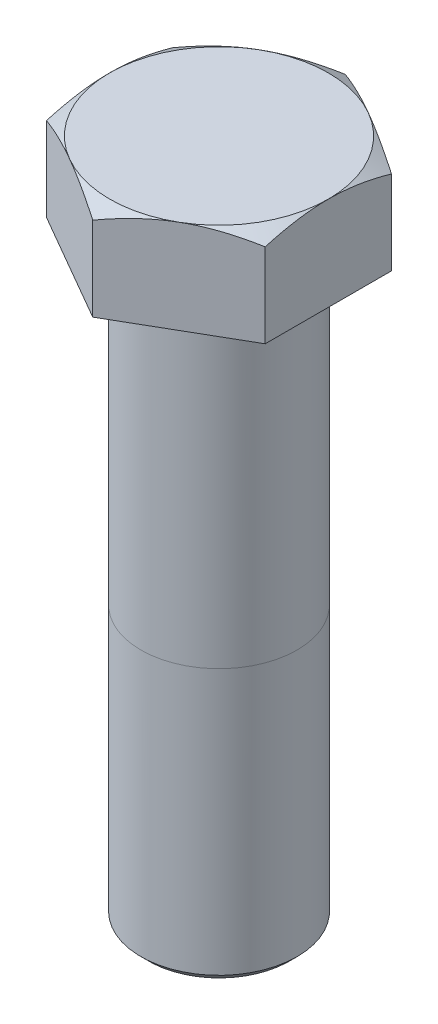
ISO-10303-21;
HEADER;
FILE_DESCRIPTION(('STEP AP214'),'2;1');
FILE_NAME('part.step','',(''),(''),'','','');
FILE_SCHEMA(('AUTOMOTIVE_DESIGN { 1 0 10303 214 1 1 1 1 }'));
ENDSEC;
DATA;
#1=APPLICATION_CONTEXT('core data for automotive mechanical design processes');
#2=APPLICATION_PROTOCOL_DEFINITION('international standard','automotive_design',2000,#1);
#3=PRODUCT_CONTEXT('',#1,'mechanical');
#4=PRODUCT('Part','Part','',(#3));
#5=PRODUCT_RELATED_PRODUCT_CATEGORY('part','',(#4));
#6=PRODUCT_DEFINITION_FORMATION('','',#4);
#7=PRODUCT_DEFINITION_CONTEXT('part definition',#1,'design');
#8=PRODUCT_DEFINITION('design','',#6,#7);
#9=PRODUCT_DEFINITION_SHAPE('','',#8);
#10=(LENGTH_UNIT() NAMED_UNIT(*) SI_UNIT(.MILLI.,.METRE.));
#11=(NAMED_UNIT(*) PLANE_ANGLE_UNIT() SI_UNIT($,.RADIAN.));
#12=(NAMED_UNIT(*) SI_UNIT($,.STERADIAN.) SOLID_ANGLE_UNIT());
#13=UNCERTAINTY_MEASURE_WITH_UNIT(LENGTH_MEASURE(1.E-05),#10,'distance_accuracy_value','');
#14=(GEOMETRIC_REPRESENTATION_CONTEXT(3) GLOBAL_UNCERTAINTY_ASSIGNED_CONTEXT((#13)) GLOBAL_UNIT_ASSIGNED_CONTEXT((#10,
#11,#12)) REPRESENTATION_CONTEXT('',''));
#15=CARTESIAN_POINT('',(0.,0.,0.));
#16=DIRECTION('',(0.,0.,1.));
#17=DIRECTION('',(1.,0.,0.));
#18=AXIS2_PLACEMENT_3D('',#15,#16,#17);
#19=CARTESIAN_POINT('',(0.,-75.,0.));
#20=DIRECTION('',(0.,1.,0.));
#21=DIRECTION('',(0.,0.,1.));
#22=AXIS2_PLACEMENT_3D('',#19,#20,#21);
#23=CYLINDRICAL_SURFACE('',#22,10.);
#24=CARTESIAN_POINT('',(0.,-74.,0.));
#25=DIRECTION('',(0.,-1.,0.));
#26=DIRECTION('',(0.,0.,-1.));
#27=AXIS2_PLACEMENT_3D('',#24,#25,#26);
#28=CIRCLE('',#27,10.);
#29=CARTESIAN_POINT('',(0.,-74.,-10.));
#30=VERTEX_POINT('',#29);
#31=EDGE_CURVE('E247',#30,#30,#28,.F.);
#32=ORIENTED_EDGE('',*,*,#31,.T.);
#33=EDGE_LOOP('',(#32));
#34=FACE_BOUND('',#33,.T.);
#35=CARTESIAN_POINT('',(0.,-40.,0.));
#36=DIRECTION('',(0.,1.,0.));
#37=DIRECTION('',(0.,0.,1.));
#38=AXIS2_PLACEMENT_3D('',#35,#36,#37);
#39=CIRCLE('',#38,10.);
#40=CARTESIAN_POINT('',(10.,-40.,0.));
#41=VERTEX_POINT('',#40);
#42=CARTESIAN_POINT('',(-10.,-40.,0.));
#43=VERTEX_POINT('',#42);
#44=EDGE_CURVE('E12',#41,#43,#39,.T.);
#45=ORIENTED_EDGE('',*,*,#44,.F.);
#46=EDGE_CURVE('E46',#43,#41,#39,.T.);
#47=ORIENTED_EDGE('',*,*,#46,.F.);
#48=EDGE_LOOP('',(#45,#47));
#49=FACE_BOUND('',#48,.T.);
#50=ADVANCED_FACE('F42',(#34,#49),#23,.T.);
#51=CARTESIAN_POINT('',(14.,12.,8.08290376865476));
#52=DIRECTION('',(-1.,0.,0.));
#53=DIRECTION('',(0.,0.,1.));
#54=AXIS2_PLACEMENT_3D('',#51,#52,#53);
#55=PLANE('',#54);
#56=CARTESIAN_POINT('',(14.,4.99292627411983,-22.0708464349856));
#57=CARTESIAN_POINT('',(14.,5.14275125073714,-21.763531713594));
#58=CARTESIAN_POINT('',(14.,5.2918557374687,-21.4558658946682));
#59=CARTESIAN_POINT('',(14.,5.58846120919052,-20.8397589075048));
#60=CARTESIAN_POINT('',(14.,5.73596217910168,-20.5313177320094));
#61=CARTESIAN_POINT('',(14.,6.17585267186017,-19.6046440518659));
#62=CARTESIAN_POINT('',(14.,6.46558794103416,-18.9851469805474));
#63=CARTESIAN_POINT('',(14.,7.03777843217461,-17.7389229296623));
#64=CARTESIAN_POINT('',(14.,7.32018844259814,-17.1121751438084));
#65=CARTESIAN_POINT('',(14.,7.87392351617632,-15.8538185498974));
#66=CARTESIAN_POINT('',(14.,8.1452490804189,-15.2222099631169));
#67=CARTESIAN_POINT('',(14.,8.68287642466604,-13.9315623858743));
#68=CARTESIAN_POINT('',(14.,8.94869404876374,-13.2723206995769));
#69=CARTESIAN_POINT('',(14.,9.46106816037286,-11.9462542996072));
#70=CARTESIAN_POINT('',(14.,9.70762253788817,-11.279428764378));
#71=CARTESIAN_POINT('',(14.,10.1752562829552,-9.93829007470015));
#72=CARTESIAN_POINT('',(14.,10.396384227389,-9.26399399013318));
#73=CARTESIAN_POINT('',(14.,10.8063230716423,-7.90567438619098));
#74=CARTESIAN_POINT('',(14.,10.9951437751515,-7.22165388619106));
#75=CARTESIAN_POINT('',(14.,11.2469826274844,-6.19005259244248));
#76=CARTESIAN_POINT('',(14.,11.3255182689362,-5.84623937601681));
#77=CARTESIAN_POINT('',(14.,11.4712203231808,-5.15619981120414));
#78=CARTESIAN_POINT('',(14.,11.5383869516181,-4.80997350871765));
#79=CARTESIAN_POINT('',(14.,11.6601886053096,-4.11532107569089));
#80=CARTESIAN_POINT('',(14.,11.7148239340997,-3.76689499864416));
#81=CARTESIAN_POINT('',(14.,11.8104879102852,-3.06818296151865));
#82=CARTESIAN_POINT('',(14.,11.8515171744298,-2.71789708647414));
#83=CARTESIAN_POINT('',(14.,11.9186189966348,-2.02068299874687));
#84=CARTESIAN_POINT('',(14.,11.9448869150742,-1.67377370516229));
#85=CARTESIAN_POINT('',(14.,11.9827143530094,-0.979154587539554));
#86=CARTESIAN_POINT('',(14.,11.9942741270491,-0.631444777459724));
#87=CARTESIAN_POINT('',(14.,12.0024083352431,0.0641555436403101));
#88=CARTESIAN_POINT('',(14.,11.9989826831407,0.412046055689117));
#89=CARTESIAN_POINT('',(14.,11.9772334595719,1.10736454649816));
#90=CARTESIAN_POINT('',(14.,11.9589092283266,1.4547925040918));
#91=CARTESIAN_POINT('',(14.,11.8981630222529,2.27898980794397));
#92=CARTESIAN_POINT('',(14.,11.8492724601065,2.75529344550535));
#93=CARTESIAN_POINT('',(14.,11.7260767898435,3.70457641615979));
#94=CARTESIAN_POINT('',(14.,11.6517685310033,4.17755532970575));
#95=CARTESIAN_POINT('',(14.,11.3946404748962,5.5908323945973));
#96=CARTESIAN_POINT('',(14.,11.1776561389664,6.52500889593941));
#97=CARTESIAN_POINT('',(14.,10.798626820434,7.9226389185731));
#98=CARTESIAN_POINT('',(14.,10.6614717947017,8.39326123057304));
#99=CARTESIAN_POINT('',(14.,10.3722342331957,9.32994176724345));
#100=CARTESIAN_POINT('',(14.,10.2201515814648,9.79599995642904));
#101=CARTESIAN_POINT('',(14.,9.90355317631269,10.7236894043673));
#102=CARTESIAN_POINT('',(14.,9.73904087835879,11.1853218535627));
#103=CARTESIAN_POINT('',(14.,9.39959441341048,12.1047171749783));
#104=CARTESIAN_POINT('',(14.,9.22466049104052,12.5624801377385));
#105=CARTESIAN_POINT('',(14.,8.89155940415481,13.4097205820374));
#106=CARTESIAN_POINT('',(14.,8.73454468424756,13.7996530958132));
#107=CARTESIAN_POINT('',(14.,8.41497628488326,14.5772449404882));
#108=CARTESIAN_POINT('',(14.,8.25242251511154,14.9649042342014));
#109=CARTESIAN_POINT('',(14.,7.75759096859983,16.1248984757426));
#110=CARTESIAN_POINT('',(14.,7.41816794173889,16.8941869656031));
#111=CARTESIAN_POINT('',(14.,6.72486730980364,18.426543943353));
#112=CARTESIAN_POINT('',(14.,6.37098406545459,19.1896098626505));
#113=CARTESIAN_POINT('',(14.,5.65222073830814,20.7104937194635));
#114=CARTESIAN_POINT('',(14.,5.28734111642613,21.4683118753073));
#115=CARTESIAN_POINT('',(14.,4.54839511560173,22.980981438601));
#116=CARTESIAN_POINT('',(14.,4.17431468233873,23.7358259632096));
#117=CARTESIAN_POINT('',(14.,3.41933164006676,25.2420982335973));
#118=CARTESIAN_POINT('',(14.,3.03842897255752,25.9935259500081));
#119=CARTESIAN_POINT('',(14.,2.27123454463828,27.4934100989246));
#120=CARTESIAN_POINT('',(14.,1.88494400638628,28.2418671573457));
#121=CARTESIAN_POINT('',(14.,1.10790624992866,29.7364586122523));
#122=CARTESIAN_POINT('',(14.,0.71715904651957,30.4825930164389));
#123=CARTESIAN_POINT('',(14.,-0.376681710678396,32.558895705312));
#124=CARTESIAN_POINT('',(14.,-1.08377517374297,33.8869563019828));
#125=CARTESIAN_POINT('',(14.,-2.50642277339758,36.5386359764744));
#126=CARTESIAN_POINT('',(14.,-3.22197744331924,37.8622547674929));
#127=CARTESIAN_POINT('',(14.,-4.65694236685034,40.5015600986259));
#128=CARTESIAN_POINT('',(14.,-5.37633118483277,41.8172583005949));
#129=CARTESIAN_POINT('',(14.,-6.45898623229571,43.7887734158136));
#130=CARTESIAN_POINT('',(14.,-6.82045208995986,44.4455803149352));
#131=CARTESIAN_POINT('',(14.,-7.54445048557498,45.7586049329431));
#132=CARTESIAN_POINT('',(14.,-7.90698302220202,46.4148226525593));
#133=CARTESIAN_POINT('',(14.,-8.26998269061017,47.0707819322765));
#134=B_SPLINE_CURVE_WITH_KNOTS('',3,(#56,#57,#58,#59,#60,#61,#62,#63,#64,#65,#66,#67,#68,#69,
#70,#71,#72,#73,#74,#75,#76,#77,#78,#79,#80,#81,#82,#83,#84,#85,#86,#87,#88,#89,#90,#91,#92,#93,
#94,#95,#96,#97,#98,#99,#100,#101,#102,#103,#104,#105,#106,#107,#108,#109,#110,#111,#112,#113,
#114,#115,#116,#117,#118,#119,#120,#121,#122,#123,#124,#125,#126,#127,#128,#129,#130,#131,#132,
#133),.UNSPECIFIED.,.F.,.F.,(4,2,2,2,2,2,2,2,2,2,2,2,2,2,2,2,2,2,2,2,2,2,2,2,2,2,2,2,2,2,2,2,2,
2,2,2,2,2,4),(0.,1.02567303415568,2.05135570517911,4.10300682741262,6.16523090737517,
8.2273616582163,10.3595780473828,12.4920276619918,14.6203330796551,16.7479915093961,
17.8058407791356,18.8636699816202,19.9214735584228,20.979229179497,22.022634632188,
23.066022027118,24.1094154278302,25.1528550374109,26.5884704486536,28.0242638802512,
30.8972352289157,32.3677049505682,33.8381860956821,35.3082599376037,36.7782992863959,
38.0393272664398,39.3003758174946,41.8226756734989,44.3459687576769,46.869156224211,
49.3964720626359,51.9238095830388,54.450582848693,56.977347727673,61.4910052964854,
66.0049489056214,70.5035167422898,72.7526215874592,75.0017236422816),.UNSPECIFIED.);
#135=CARTESIAN_POINT('',(14.,10.7495704353214,8.08290376865476));
#136=VERTEX_POINT('',#135);
#137=CARTESIAN_POINT('',(14.,12.,0.));
#138=VERTEX_POINT('',#137);
#139=EDGE_CURVE('E115',#136,#138,#134,.F.);
#140=ORIENTED_EDGE('',*,*,#139,.F.);
#141=DIRECTION('',(0.,-1.,0.));
#142=VECTOR('',#141,1.);
#143=CARTESIAN_POINT('',(14.,12.,8.08290376865476));
#144=LINE('',#143,#142);
#145=CARTESIAN_POINT('',(14.,0.,8.08290376865476));
#146=VERTEX_POINT('',#145);
#147=EDGE_CURVE('E262',#136,#146,#144,.T.);
#148=ORIENTED_EDGE('',*,*,#147,.T.);
#149=DIRECTION('',(0.,0.,-1.));
#150=VECTOR('',#149,1.);
#151=CARTESIAN_POINT('',(14.,0.,8.08290376865476));
#152=LINE('',#151,#150);
#153=CARTESIAN_POINT('',(14.,0.,-8.08290376865476));
#154=VERTEX_POINT('',#153);
#155=EDGE_CURVE('E125',#146,#154,#152,.T.);
#156=ORIENTED_EDGE('',*,*,#155,.T.);
#157=DIRECTION('',(0.,-1.,0.));
#158=VECTOR('',#157,1.);
#159=CARTESIAN_POINT('',(14.,12.,-8.08290376865476));
#160=LINE('',#159,#158);
#161=CARTESIAN_POINT('',(14.,10.7495704353214,-8.08290376865476));
#162=VERTEX_POINT('',#161);
#163=EDGE_CURVE('E150',#162,#154,#160,.T.);
#164=ORIENTED_EDGE('',*,*,#163,.F.);
#165=EDGE_CURVE('E126',#138,#162,#134,.F.);
#166=ORIENTED_EDGE('',*,*,#165,.F.);
#167=EDGE_LOOP('',(#140,#148,#156,#164,#166));
#168=FACE_BOUND('',#167,.T.);
#169=ADVANCED_FACE('F148',(#168),#55,.F.);
#170=CARTESIAN_POINT('',(14.,12.,-8.08290376865476));
#171=DIRECTION('',(-0.5,0.,0.866025403784439));
#172=DIRECTION('',(0.866025403784439,0.,0.5));
#173=AXIS2_PLACEMENT_3D('',#170,#171,#172);
#174=PLANE('',#173);
#175=CARTESIAN_POINT('',(14.0002,10.7495037679405,-8.08278829860092));
#176=CARTESIAN_POINT('',(13.6924853904181,10.8520687355185,-8.26044741127663));
#177=CARTESIAN_POINT('',(13.3835705284393,10.9499795109551,-8.43879948999676));
#178=CARTESIAN_POINT('',(12.7632636692859,11.1351989694353,-8.79693382210911));
#179=CARTESIAN_POINT('',(12.4518708930622,11.2225041654761,-8.97671652528557));
#180=CARTESIAN_POINT('',(11.8260063991707,11.3853389062415,-9.33805955931008));
#181=CARTESIAN_POINT('',(11.5115292047329,11.4608405894043,-9.51962305217276));
#182=CARTESIAN_POINT('',(10.8803895759989,11.5984470625897,-9.88401168671854));
#183=CARTESIAN_POINT('',(10.5637272674325,11.6605526168897,-10.0668367558116));
#184=CARTESIAN_POINT('',(9.93633151674919,11.7687252680104,-10.429063861357));
#185=CARTESIAN_POINT('',(9.62564465325543,11.8151503964399,-10.6084390056288));
#186=CARTESIAN_POINT('',(9.00284729327513,11.8929951265451,-10.968011229064));
#187=CARTESIAN_POINT('',(8.69073676950318,11.9244144393938,-11.1482083239807));
#188=CARTESIAN_POINT('',(8.06599141476663,11.9714542186344,-11.5089052227128));
#189=CARTESIAN_POINT('',(7.75335765114504,11.9870934589966,-11.6894044102975));
#190=CARTESIAN_POINT('',(7.12780152662096,12.0022367596143,-12.0505694071847));
#191=CARTESIAN_POINT('',(6.81487917493453,12.0017413184259,-12.2312352111663));
#192=CARTESIAN_POINT('',(6.22987230119103,11.9857422399056,-12.5689890871999));
#193=CARTESIAN_POINT('',(5.95774609067865,11.9721901053227,-12.7261012280928));
#194=CARTESIAN_POINT('',(5.4141196223319,11.9331392398875,-13.0399641159314));
#195=CARTESIAN_POINT('',(5.14261941013851,11.9076396640127,-13.1967148365263));
#196=CARTESIAN_POINT('',(4.60039240839668,11.8451385190432,-13.5097697419438));
#197=CARTESIAN_POINT('',(4.32966644468922,11.8081274502385,-13.6660734499669));
#198=CARTESIAN_POINT('',(3.78948373337593,11.7232526731859,-13.9779480837552));
#199=CARTESIAN_POINT('',(3.52002707332628,11.6753882271492,-14.1335189589698));
#200=CARTESIAN_POINT('',(2.70207638818785,11.514304872236,-14.6057630072183));
#201=CARTESIAN_POINT('',(2.15595101855753,11.3850242516312,-14.9210686363857));
#202=CARTESIAN_POINT('',(1.07184369066131,11.0916100987946,-15.546978293977));
#203=CARTESIAN_POINT('',(0.53384785211266,10.9275454762133,-15.857590336186));
#204=CARTESIAN_POINT('',(-0.000199999999997906,10.7495037679405,-16.1659230073634));
#205=B_SPLINE_CURVE_WITH_KNOTS('',3,(#175,#176,#177,#178,#179,#180,#181,#182,#183,#184,#185,
#186,#187,#188,#189,#190,#191,#192,#193,#194,#195,#196,#197,#198,#199,#200,#201,#202,#203,#204),
.UNSPECIFIED.,.F.,.F.,(4,2,2,2,2,2,2,2,2,2,2,2,2,2,4),(0.,1.10950436744395,2.21937254652007,
3.33182219257025,4.44420835421649,5.52913815688045,6.6140888410734,7.69774720328185,
8.78137208085321,9.72469383358151,10.6680823159394,11.6122513923123,12.5564846704803,
14.4864746839191,16.412676387916),.UNSPECIFIED.);
#206=CARTESIAN_POINT('',(7.,12.,-12.1243556529821));
#207=VERTEX_POINT('',#206);
#208=EDGE_CURVE('E133',#162,#207,#205,.T.);
#209=ORIENTED_EDGE('',*,*,#208,.F.);
#210=ORIENTED_EDGE('',*,*,#163,.T.);
#211=DIRECTION('',(-0.866025403784439,0.,-0.5));
#212=VECTOR('',#211,1.);
#213=CARTESIAN_POINT('',(14.,0.,-8.08290376865476));
#214=LINE('',#213,#212);
#215=CARTESIAN_POINT('',(0.,0.,-16.1658075373095));
#216=VERTEX_POINT('',#215);
#217=EDGE_CURVE('E275',#154,#216,#214,.T.);
#218=ORIENTED_EDGE('',*,*,#217,.T.);
#219=DIRECTION('',(0.,-1.,0.));
#220=VECTOR('',#219,1.);
#221=CARTESIAN_POINT('',(0.,12.,-16.1658075373095));
#222=LINE('',#221,#220);
#223=CARTESIAN_POINT('',(0.,10.7495704353214,-16.1658075373095));
#224=VERTEX_POINT('',#223);
#225=EDGE_CURVE('E254',#224,#216,#222,.T.);
#226=ORIENTED_EDGE('',*,*,#225,.F.);
#227=EDGE_CURVE('E151',#207,#224,#205,.T.);
#228=ORIENTED_EDGE('',*,*,#227,.F.);
#229=EDGE_LOOP('',(#209,#210,#218,#226,#228));
#230=FACE_BOUND('',#229,.T.);
#231=ADVANCED_FACE('F171',(#230),#174,.F.);
#232=CARTESIAN_POINT('',(0.,12.,-16.1658075373095));
#233=DIRECTION('',(0.5,0.,0.866025403784439));
#234=DIRECTION('',(0.866025403784439,0.,-0.5));
#235=AXIS2_PLACEMENT_3D('',#232,#233,#234);
#236=PLANE('',#235);
#237=CARTESIAN_POINT('',(0.000200000000002302,10.7495037679405,-16.1659230073634));
#238=CARTESIAN_POINT('',(-0.307514609581917,10.8520687355185,-15.9882638946877));
#239=CARTESIAN_POINT('',(-0.616429471560715,10.9499795109551,-15.8099118159675));
#240=CARTESIAN_POINT('',(-1.23673633071406,11.1351989694353,-15.4517774838552));
#241=CARTESIAN_POINT('',(-1.54812910693775,11.2225041654761,-15.2719947806787));
#242=CARTESIAN_POINT('',(-2.17399360082929,11.3853389062415,-14.9106517466542));
#243=CARTESIAN_POINT('',(-2.48847079526713,11.4608405894043,-14.7290882537915));
#244=CARTESIAN_POINT('',(-3.11961042400106,11.5984470625897,-14.3646996192457));
#245=CARTESIAN_POINT('',(-3.43627273256745,11.6605526168897,-14.1818745501527));
#246=CARTESIAN_POINT('',(-4.06366848325081,11.7687252680104,-13.8196474446073));
#247=CARTESIAN_POINT('',(-4.37435534674457,11.8151503964399,-13.6402723003355));
#248=CARTESIAN_POINT('',(-4.99715270672487,11.8929951265451,-13.2807000769003));
#249=CARTESIAN_POINT('',(-5.30926323049682,11.9244144393938,-13.1005029819836));
#250=CARTESIAN_POINT('',(-5.93400858523337,11.9714542186344,-12.7398060832515));
#251=CARTESIAN_POINT('',(-6.24664234885496,11.9870934589966,-12.5593068956668));
#252=CARTESIAN_POINT('',(-6.87219847337904,12.0022367596143,-12.1981418987796));
#253=CARTESIAN_POINT('',(-7.18512082506546,12.0017413184259,-12.017476094798));
#254=CARTESIAN_POINT('',(-7.77012769880897,11.9857422399056,-11.6797222187644));
#255=CARTESIAN_POINT('',(-8.04225390932135,11.9721901053227,-11.5226100778715));
#256=CARTESIAN_POINT('',(-8.5858803776681,11.9331392398875,-11.2087471900329));
#257=CARTESIAN_POINT('',(-8.85738058986148,11.9076396640127,-11.051996469438));
#258=CARTESIAN_POINT('',(-9.39960759160332,11.8451385190432,-10.7389415640205));
#259=CARTESIAN_POINT('',(-9.67033355531079,11.8081274502385,-10.5826378559974));
#260=CARTESIAN_POINT('',(-10.2105162666241,11.7232526731859,-10.2707632222091));
#261=CARTESIAN_POINT('',(-10.4799729266737,11.6753882271492,-10.1151923469945));
#262=CARTESIAN_POINT('',(-11.2979236118122,11.514304872236,-9.64294829874595));
#263=CARTESIAN_POINT('',(-11.8440489814425,11.3850242516312,-9.3276426695786));
#264=CARTESIAN_POINT('',(-12.9281563093387,11.0916100987946,-8.70173301198727));
#265=CARTESIAN_POINT('',(-13.4661521478873,10.9275454762133,-8.39112096977831));
#266=CARTESIAN_POINT('',(-14.0002,10.7495037679405,-8.08278829860092));
#267=B_SPLINE_CURVE_WITH_KNOTS('',3,(#237,#238,#239,#240,#241,#242,#243,#244,#245,#246,#247,
#248,#249,#250,#251,#252,#253,#254,#255,#256,#257,#258,#259,#260,#261,#262,#263,#264,#265,#266),
.UNSPECIFIED.,.F.,.F.,(4,2,2,2,2,2,2,2,2,2,2,2,2,2,4),(0.,1.10950436744395,2.21937254652007,
3.33182219257025,4.44420835421649,5.52913815688045,6.6140888410734,7.69774720328185,
8.78137208085321,9.72469383358151,10.6680823159394,11.6122513923123,12.5564846704803,
14.4864746839191,16.412676387916),.UNSPECIFIED.);
#268=CARTESIAN_POINT('',(-7.,12.,-12.1243556529821));
#269=VERTEX_POINT('',#268);
#270=EDGE_CURVE('E190',#224,#269,#267,.T.);
#271=ORIENTED_EDGE('',*,*,#270,.F.);
#272=ORIENTED_EDGE('',*,*,#225,.T.);
#273=DIRECTION('',(-0.866025403784439,0.,0.5));
#274=VECTOR('',#273,1.);
#275=CARTESIAN_POINT('',(0.,0.,-16.1658075373095));
#276=LINE('',#275,#274);
#277=CARTESIAN_POINT('',(-14.,0.,-8.08290376865476));
#278=VERTEX_POINT('',#277);
#279=EDGE_CURVE('E273',#216,#278,#276,.T.);
#280=ORIENTED_EDGE('',*,*,#279,.T.);
#281=DIRECTION('',(0.,-1.,0.));
#282=VECTOR('',#281,1.);
#283=CARTESIAN_POINT('',(-14.,12.,-8.08290376865476));
#284=LINE('',#283,#282);
#285=CARTESIAN_POINT('',(-14.,10.7495704353214,-8.08290376865476));
#286=VERTEX_POINT('',#285);
#287=EDGE_CURVE('E256',#286,#278,#284,.T.);
#288=ORIENTED_EDGE('',*,*,#287,.F.);
#289=EDGE_CURVE('E184',#269,#286,#267,.T.);
#290=ORIENTED_EDGE('',*,*,#289,.F.);
#291=EDGE_LOOP('',(#271,#272,#280,#288,#290));
#292=FACE_BOUND('',#291,.T.);
#293=ADVANCED_FACE('F175',(#292),#236,.F.);
#294=CARTESIAN_POINT('',(-14.,12.,-8.08290376865476));
#295=DIRECTION('',(1.,0.,0.));
#296=DIRECTION('',(0.,0.,-1.));
#297=AXIS2_PLACEMENT_3D('',#294,#295,#296);
#298=PLANE('',#297);
#299=CARTESIAN_POINT('',(-14.,4.99292627411983,-22.0708464349856));
#300=CARTESIAN_POINT('',(-14.,5.14275125073714,-21.763531713594));
#301=CARTESIAN_POINT('',(-14.,5.2918557374687,-21.4558658946682));
#302=CARTESIAN_POINT('',(-14.,5.58846120919052,-20.8397589075048));
#303=CARTESIAN_POINT('',(-14.,5.73596217910168,-20.5313177320094));
#304=CARTESIAN_POINT('',(-14.,6.17585267186017,-19.6046440518659));
#305=CARTESIAN_POINT('',(-14.,6.46558794103416,-18.9851469805474));
#306=CARTESIAN_POINT('',(-14.,7.03777843217461,-17.7389229296623));
#307=CARTESIAN_POINT('',(-14.,7.32018844259814,-17.1121751438084));
#308=CARTESIAN_POINT('',(-14.,7.87392351617632,-15.8538185498974));
#309=CARTESIAN_POINT('',(-14.,8.1452490804189,-15.2222099631169));
#310=CARTESIAN_POINT('',(-14.,8.68287642466604,-13.9315623858743));
#311=CARTESIAN_POINT('',(-14.,8.94869404876374,-13.2723206995769));
#312=CARTESIAN_POINT('',(-14.,9.46106816037286,-11.9462542996072));
#313=CARTESIAN_POINT('',(-14.,9.70762253788817,-11.279428764378));
#314=CARTESIAN_POINT('',(-14.,10.1752562829552,-9.93829007470015));
#315=CARTESIAN_POINT('',(-14.,10.396384227389,-9.26399399013318));
#316=CARTESIAN_POINT('',(-14.,10.8063230716423,-7.90567438619097));
#317=CARTESIAN_POINT('',(-14.,10.9951437751515,-7.22165388619105));
#318=CARTESIAN_POINT('',(-14.,11.2469826274844,-6.19005259244248));
#319=CARTESIAN_POINT('',(-14.,11.3255182689362,-5.84623937601681));
#320=CARTESIAN_POINT('',(-14.,11.4712203231808,-5.15619981120413));
#321=CARTESIAN_POINT('',(-14.,11.5383869516181,-4.80997350871764));
#322=CARTESIAN_POINT('',(-14.,11.6601886053096,-4.11532107569088));
#323=CARTESIAN_POINT('',(-14.,11.7148239340997,-3.76689499864415));
#324=CARTESIAN_POINT('',(-14.,11.8104879102852,-3.06818296151865));
#325=CARTESIAN_POINT('',(-14.,11.8515171744298,-2.71789708647413));
#326=CARTESIAN_POINT('',(-14.,11.9186189966348,-2.02068299874686));
#327=CARTESIAN_POINT('',(-14.,11.9448869150742,-1.67377370516228));
#328=CARTESIAN_POINT('',(-14.,11.9827143530094,-0.979154587539547));
#329=CARTESIAN_POINT('',(-14.,11.9942741270491,-0.631444777459719));
#330=CARTESIAN_POINT('',(-14.,12.0024083352431,0.0641555436403141));
#331=CARTESIAN_POINT('',(-14.,11.9989826831407,0.412046055689121));
#332=CARTESIAN_POINT('',(-14.,11.9772334595719,1.10736454649816));
#333=CARTESIAN_POINT('',(-14.,11.9589092283266,1.4547925040918));
#334=CARTESIAN_POINT('',(-14.,11.8981630222529,2.27898980794397));
#335=CARTESIAN_POINT('',(-14.,11.8492724601065,2.75529344550535));
#336=CARTESIAN_POINT('',(-14.,11.7260767898435,3.70457641615979));
#337=CARTESIAN_POINT('',(-14.,11.6517685310033,4.17755532970575));
#338=CARTESIAN_POINT('',(-14.,11.3946404748962,5.5908323945973));
#339=CARTESIAN_POINT('',(-14.,11.1776561389664,6.52500889593941));
#340=CARTESIAN_POINT('',(-14.,10.798626820434,7.9226389185731));
#341=CARTESIAN_POINT('',(-14.,10.6614717947017,8.39326123057304));
#342=CARTESIAN_POINT('',(-14.,10.3722342331957,9.32994176724345));
#343=CARTESIAN_POINT('',(-14.,10.2201515814648,9.79599995642904));
#344=CARTESIAN_POINT('',(-14.,9.90355317631269,10.7236894043673));
#345=CARTESIAN_POINT('',(-14.,9.73904087835879,11.1853218535627));
#346=CARTESIAN_POINT('',(-14.,9.39959441341048,12.1047171749783));
#347=CARTESIAN_POINT('',(-14.,9.22466049104052,12.5624801377385));
#348=CARTESIAN_POINT('',(-14.,8.89155940415481,13.4097205820374));
#349=CARTESIAN_POINT('',(-14.,8.73454468424756,13.7996530958132));
#350=CARTESIAN_POINT('',(-14.,8.41497628488325,14.5772449404882));
#351=CARTESIAN_POINT('',(-14.,8.25242251511153,14.9649042342014));
#352=CARTESIAN_POINT('',(-14.,7.75759096859983,16.1248984757426));
#353=CARTESIAN_POINT('',(-14.,7.41816794173889,16.8941869656031));
#354=CARTESIAN_POINT('',(-14.,6.72486730980363,18.426543943353));
#355=CARTESIAN_POINT('',(-14.,6.37098406545459,19.1896098626505));
#356=CARTESIAN_POINT('',(-14.,5.65222073830813,20.7104937194635));
#357=CARTESIAN_POINT('',(-14.,5.28734111642612,21.4683118753073));
#358=CARTESIAN_POINT('',(-14.,4.54839511560173,22.9809814386011));
#359=CARTESIAN_POINT('',(-14.,4.17431468233872,23.7358259632096));
#360=CARTESIAN_POINT('',(-14.,3.41933164006675,25.2420982335973));
#361=CARTESIAN_POINT('',(-14.,3.03842897255752,25.9935259500081));
#362=CARTESIAN_POINT('',(-14.,2.27123454463827,27.4934100989246));
#363=CARTESIAN_POINT('',(-14.,1.88494400638627,28.2418671573457));
#364=CARTESIAN_POINT('',(-14.,1.10790624992864,29.7364586122524));
#365=CARTESIAN_POINT('',(-14.,0.717159046519553,30.4825930164389));
#366=CARTESIAN_POINT('',(-14.,-0.376681710678413,32.558895705312));
#367=CARTESIAN_POINT('',(-14.,-1.08377517374298,33.8869563019829));
#368=CARTESIAN_POINT('',(-14.,-2.50642277339759,36.5386359764745));
#369=CARTESIAN_POINT('',(-14.,-3.22197744331926,37.8622547674929));
#370=CARTESIAN_POINT('',(-14.,-4.65694236685035,40.5015600986259));
#371=CARTESIAN_POINT('',(-14.,-5.37633118483277,41.8172583005949));
#372=CARTESIAN_POINT('',(-14.,-6.45898623229571,43.7887734158136));
#373=CARTESIAN_POINT('',(-14.,-6.82045208995986,44.4455803149352));
#374=CARTESIAN_POINT('',(-14.,-7.54445048557499,45.7586049329431));
#375=CARTESIAN_POINT('',(-14.,-7.90698302220203,46.4148226525593));
#376=CARTESIAN_POINT('',(-14.,-8.26998269061017,47.0707819322765));
#377=B_SPLINE_CURVE_WITH_KNOTS('',3,(#299,#300,#301,#302,#303,#304,#305,#306,#307,#308,#309,
#310,#311,#312,#313,#314,#315,#316,#317,#318,#319,#320,#321,#322,#323,#324,#325,#326,#327,#328,
#329,#330,#331,#332,#333,#334,#335,#336,#337,#338,#339,#340,#341,#342,#343,#344,#345,#346,#347,
#348,#349,#350,#351,#352,#353,#354,#355,#356,#357,#358,#359,#360,#361,#362,#363,#364,#365,#366,
#367,#368,#369,#370,#371,#372,#373,#374,#375,#376),.UNSPECIFIED.,.F.,.F.,(4,2,2,2,2,2,2,2,2,2,2,
2,2,2,2,2,2,2,2,2,2,2,2,2,2,2,2,2,2,2,2,2,2,2,2,2,2,2,4),(0.,1.02567303415568,2.0513557051791,
4.10300682741262,6.16523090737516,8.22736165821629,10.3595780473828,12.4920276619918,
14.620333079655,16.7479915093961,17.8058407791356,18.8636699816202,19.9214735584228,
20.979229179497,22.022634632188,23.066022027118,24.1094154278302,25.1528550374109,
26.5884704486535,28.0242638802512,30.8972352289157,32.3677049505681,33.8381860956821,
35.3082599376037,36.7782992863959,38.0393272664398,39.3003758174946,41.8226756734989,
44.3459687576769,46.869156224211,49.3964720626359,51.9238095830388,54.450582848693,
56.977347727673,61.4910052964854,66.0049489056214,70.5035167422898,72.7526215874592,
75.0017236422816),.UNSPECIFIED.);
#378=CARTESIAN_POINT('',(-14.,12.,0.));
#379=VERTEX_POINT('',#378);
#380=EDGE_CURVE('E191',#286,#379,#377,.T.);
#381=ORIENTED_EDGE('',*,*,#380,.F.);
#382=ORIENTED_EDGE('',*,*,#287,.T.);
#383=DIRECTION('',(0.,0.,1.));
#384=VECTOR('',#383,1.);
#385=CARTESIAN_POINT('',(-14.,0.,-8.08290376865476));
#386=LINE('',#385,#384);
#387=CARTESIAN_POINT('',(-14.,0.,8.08290376865476));
#388=VERTEX_POINT('',#387);
#389=EDGE_CURVE('E270',#278,#388,#386,.T.);
#390=ORIENTED_EDGE('',*,*,#389,.T.);
#391=DIRECTION('',(0.,-1.,0.));
#392=VECTOR('',#391,1.);
#393=CARTESIAN_POINT('',(-14.,12.,8.08290376865476));
#394=LINE('',#393,#392);
#395=CARTESIAN_POINT('',(-14.,10.7495704353214,8.08290376865476));
#396=VERTEX_POINT('',#395);
#397=EDGE_CURVE('E258',#396,#388,#394,.T.);
#398=ORIENTED_EDGE('',*,*,#397,.F.);
#399=EDGE_CURVE('E192',#379,#396,#377,.T.);
#400=ORIENTED_EDGE('',*,*,#399,.F.);
#401=EDGE_LOOP('',(#381,#382,#390,#398,#400));
#402=FACE_BOUND('',#401,.T.);
#403=ADVANCED_FACE('F180',(#402),#298,.F.);
#404=CARTESIAN_POINT('',(-14.,12.,8.08290376865476));
#405=DIRECTION('',(0.5,0.,-0.866025403784439));
#406=DIRECTION('',(-0.866025403784439,0.,-0.5));
#407=AXIS2_PLACEMENT_3D('',#404,#405,#406);
#408=PLANE('',#407);
#409=CARTESIAN_POINT('',(-14.0002,10.7495037679405,8.08278829860093));
#410=CARTESIAN_POINT('',(-13.6924853904181,10.8520687355185,8.26044741127663));
#411=CARTESIAN_POINT('',(-13.3835705284393,10.9499795109551,8.43879948999676));
#412=CARTESIAN_POINT('',(-12.7632636692859,11.1351989694353,8.79693382210912));
#413=CARTESIAN_POINT('',(-12.4518708930622,11.2225041654761,8.97671652528557));
#414=CARTESIAN_POINT('',(-11.8260063991707,11.3853389062415,9.33805955931008));
#415=CARTESIAN_POINT('',(-11.5115292047329,11.4608405894043,9.51962305217277));
#416=CARTESIAN_POINT('',(-10.8803895759989,11.5984470625897,9.88401168671854));
#417=CARTESIAN_POINT('',(-10.5637272674325,11.6605526168897,10.0668367558116));
#418=CARTESIAN_POINT('',(-9.93633151674919,11.7687252680104,10.429063861357));
#419=CARTESIAN_POINT('',(-9.62564465325543,11.8151503964399,10.6084390056288));
#420=CARTESIAN_POINT('',(-9.00284729327513,11.8929951265451,10.968011229064));
#421=CARTESIAN_POINT('',(-8.69073676950318,11.9244144393938,11.1482083239807));
#422=CARTESIAN_POINT('',(-8.06599141476663,11.9714542186344,11.5089052227128));
#423=CARTESIAN_POINT('',(-7.75335765114504,11.9870934589966,11.6894044102975));
#424=CARTESIAN_POINT('',(-7.12780152662096,12.0022367596143,12.0505694071847));
#425=CARTESIAN_POINT('',(-6.81487917493453,12.0017413184259,12.2312352111663));
#426=CARTESIAN_POINT('',(-6.22987230119103,11.9857422399056,12.5689890871999));
#427=CARTESIAN_POINT('',(-5.95774609067864,11.9721901053227,12.7261012280928));
#428=CARTESIAN_POINT('',(-5.41411962233189,11.9331392398875,13.0399641159314));
#429=CARTESIAN_POINT('',(-5.14261941013851,11.9076396640127,13.1967148365263));
#430=CARTESIAN_POINT('',(-4.60039240839667,11.8451385190432,13.5097697419438));
#431=CARTESIAN_POINT('',(-4.32966644468922,11.8081274502385,13.6660734499669));
#432=CARTESIAN_POINT('',(-3.78948373337593,11.7232526731859,13.9779480837552));
#433=CARTESIAN_POINT('',(-3.52002707332628,11.6753882271492,14.1335189589698));
#434=CARTESIAN_POINT('',(-2.70207638818785,11.514304872236,14.6057630072183));
#435=CARTESIAN_POINT('',(-2.15595101855753,11.3850242516312,14.9210686363857));
#436=CARTESIAN_POINT('',(-1.07184369066131,11.0916100987946,15.546978293977));
#437=CARTESIAN_POINT('',(-0.533847852112659,10.9275454762133,15.857590336186));
#438=CARTESIAN_POINT('',(0.00019999999999751,10.7495037679405,16.1659230073634));
#439=B_SPLINE_CURVE_WITH_KNOTS('',3,(#409,#410,#411,#412,#413,#414,#415,#416,#417,#418,#419,
#420,#421,#422,#423,#424,#425,#426,#427,#428,#429,#430,#431,#432,#433,#434,#435,#436,#437,#438),
.UNSPECIFIED.,.F.,.F.,(4,2,2,2,2,2,2,2,2,2,2,2,2,2,4),(0.,1.10950436744395,2.21937254652007,
3.33182219257025,4.44420835421649,5.52913815688045,6.6140888410734,7.69774720328185,
8.78137208085321,9.72469383358151,10.6680823159394,11.6122513923123,12.5564846704803,
14.4864746839191,16.412676387916),.UNSPECIFIED.);
#440=CARTESIAN_POINT('',(-7.,12.,12.1243556529821));
#441=VERTEX_POINT('',#440);
#442=EDGE_CURVE('E198',#396,#441,#439,.T.);
#443=ORIENTED_EDGE('',*,*,#442,.F.);
#444=ORIENTED_EDGE('',*,*,#397,.T.);
#445=DIRECTION('',(0.866025403784439,0.,0.5));
#446=VECTOR('',#445,1.);
#447=CARTESIAN_POINT('',(-14.,0.,8.08290376865476));
#448=LINE('',#447,#446);
#449=CARTESIAN_POINT('',(0.,0.,16.1658075373095));
#450=VERTEX_POINT('',#449);
#451=EDGE_CURVE('E267',#388,#450,#448,.T.);
#452=ORIENTED_EDGE('',*,*,#451,.T.);
#453=DIRECTION('',(0.,-1.,0.));
#454=VECTOR('',#453,1.);
#455=CARTESIAN_POINT('',(0.,12.,16.1658075373095));
#456=LINE('',#455,#454);
#457=CARTESIAN_POINT('',(0.,10.7495704353214,16.1658075373095));
#458=VERTEX_POINT('',#457);
#459=EDGE_CURVE('E260',#458,#450,#456,.T.);
#460=ORIENTED_EDGE('',*,*,#459,.F.);
#461=EDGE_CURVE('E199',#441,#458,#439,.T.);
#462=ORIENTED_EDGE('',*,*,#461,.F.);
#463=EDGE_LOOP('',(#443,#444,#452,#460,#462));
#464=FACE_BOUND('',#463,.T.);
#465=ADVANCED_FACE('F211',(#464),#408,.F.);
#466=CARTESIAN_POINT('',(0.,12.,16.1658075373095));
#467=DIRECTION('',(-0.5,0.,-0.866025403784438));
#468=DIRECTION('',(-0.866025403784439,0.,0.5));
#469=AXIS2_PLACEMENT_3D('',#466,#467,#468);
#470=PLANE('',#469);
#471=CARTESIAN_POINT('',(-0.000200000000002374,10.7495037679405,16.1659230073634));
#472=CARTESIAN_POINT('',(0.307514609581919,10.8520687355185,15.9882638946877));
#473=CARTESIAN_POINT('',(0.616429471560717,10.9499795109551,15.8099118159675));
#474=CARTESIAN_POINT('',(1.23673633071406,11.1351989694353,15.4517774838552));
#475=CARTESIAN_POINT('',(1.54812910693776,11.2225041654761,15.2719947806787));
#476=CARTESIAN_POINT('',(2.17399360082929,11.3853389062415,14.9106517466542));
#477=CARTESIAN_POINT('',(2.48847079526713,11.4608405894043,14.7290882537915));
#478=CARTESIAN_POINT('',(3.11961042400106,11.5984470625897,14.3646996192457));
#479=CARTESIAN_POINT('',(3.43627273256745,11.6605526168897,14.1818745501527));
#480=CARTESIAN_POINT('',(4.06366848325081,11.7687252680104,13.8196474446073));
#481=CARTESIAN_POINT('',(4.37435534674457,11.8151503964399,13.6402723003355));
#482=CARTESIAN_POINT('',(4.99715270672487,11.8929951265451,13.2807000769003));
#483=CARTESIAN_POINT('',(5.30926323049682,11.9244144393938,13.1005029819836));
#484=CARTESIAN_POINT('',(5.93400858523336,11.9714542186344,12.7398060832515));
#485=CARTESIAN_POINT('',(6.24664234885496,11.9870934589966,12.5593068956668));
#486=CARTESIAN_POINT('',(6.87219847337904,12.0022367596143,12.1981418987796));
#487=CARTESIAN_POINT('',(7.18512082506546,12.0017413184259,12.017476094798));
#488=CARTESIAN_POINT('',(7.77012769880897,11.9857422399056,11.6797222187644));
#489=CARTESIAN_POINT('',(8.04225390932135,11.9721901053227,11.5226100778715));
#490=CARTESIAN_POINT('',(8.5858803776681,11.9331392398875,11.2087471900329));
#491=CARTESIAN_POINT('',(8.85738058986148,11.9076396640127,11.051996469438));
#492=CARTESIAN_POINT('',(9.39960759160332,11.8451385190432,10.7389415640205));
#493=CARTESIAN_POINT('',(9.67033355531079,11.8081274502385,10.5826378559974));
#494=CARTESIAN_POINT('',(10.2105162666241,11.7232526731859,10.2707632222091));
#495=CARTESIAN_POINT('',(10.4799729266737,11.6753882271492,10.1151923469945));
#496=CARTESIAN_POINT('',(11.2979236118122,11.514304872236,9.64294829874595));
#497=CARTESIAN_POINT('',(11.8440489814425,11.3850242516312,9.3276426695786));
#498=CARTESIAN_POINT('',(12.9281563093387,11.0916100987946,8.70173301198727));
#499=CARTESIAN_POINT('',(13.4661521478873,10.9275454762133,8.39112096977831));
#500=CARTESIAN_POINT('',(14.0002,10.7495037679405,8.08278829860092));
#501=B_SPLINE_CURVE_WITH_KNOTS('',3,(#471,#472,#473,#474,#475,#476,#477,#478,#479,#480,#481,
#482,#483,#484,#485,#486,#487,#488,#489,#490,#491,#492,#493,#494,#495,#496,#497,#498,#499,#500),
.UNSPECIFIED.,.F.,.F.,(4,2,2,2,2,2,2,2,2,2,2,2,2,2,4),(0.,1.10950436744395,2.21937254652007,
3.33182219257025,4.44420835421649,5.52913815688045,6.6140888410734,7.69774720328185,
8.78137208085321,9.72469383358151,10.6680823159394,11.6122513923124,12.5564846704803,
14.4864746839191,16.412676387916),.UNSPECIFIED.);
#502=CARTESIAN_POINT('',(7.,12.,12.1243556529821));
#503=VERTEX_POINT('',#502);
#504=EDGE_CURVE('E205',#458,#503,#501,.T.);
#505=ORIENTED_EDGE('',*,*,#504,.F.);
#506=ORIENTED_EDGE('',*,*,#459,.T.);
#507=DIRECTION('',(0.866025403784439,0.,-0.5));
#508=VECTOR('',#507,1.);
#509=CARTESIAN_POINT('',(0.,0.,16.1658075373095));
#510=LINE('',#509,#508);
#511=EDGE_CURVE('E264',#450,#146,#510,.T.);
#512=ORIENTED_EDGE('',*,*,#511,.T.);
#513=ORIENTED_EDGE('',*,*,#147,.F.);
#514=EDGE_CURVE('E121',#503,#136,#501,.T.);
#515=ORIENTED_EDGE('',*,*,#514,.F.);
#516=EDGE_LOOP('',(#505,#506,#512,#513,#515));
#517=FACE_BOUND('',#516,.T.);
#518=ADVANCED_FACE('F214',(#517),#470,.F.);
#519=CARTESIAN_POINT('',(0.,0.,0.));
#520=DIRECTION('',(0.,1.,0.));
#521=DIRECTION('',(0.,0.,1.));
#522=AXIS2_PLACEMENT_3D('',#519,#520,#521);
#523=PLANE('',#522);
#524=CARTESIAN_POINT('',(0.,0.,0.));
#525=DIRECTION('',(0.,1.,0.));
#526=DIRECTION('',(0.,0.,1.));
#527=AXIS2_PLACEMENT_3D('',#524,#525,#526);
#528=CIRCLE('',#527,10.);
#529=CARTESIAN_POINT('',(0.,0.,10.));
#530=VERTEX_POINT('',#529);
#531=EDGE_CURVE('E138',#530,#530,#528,.F.);
#532=ORIENTED_EDGE('',*,*,#531,.F.);
#533=EDGE_LOOP('',(#532));
#534=FACE_BOUND('',#533,.T.);
#535=ORIENTED_EDGE('',*,*,#155,.F.);
#536=ORIENTED_EDGE('',*,*,#511,.F.);
#537=ORIENTED_EDGE('',*,*,#451,.F.);
#538=ORIENTED_EDGE('',*,*,#389,.F.);
#539=ORIENTED_EDGE('',*,*,#279,.F.);
#540=ORIENTED_EDGE('',*,*,#217,.F.);
#541=EDGE_LOOP('',(#535,#536,#537,#538,#539,#540));
#542=FACE_BOUND('',#541,.T.);
#543=ADVANCED_FACE('F219',(#534,#542),#523,.F.);
#544=CARTESIAN_POINT('',(0.,12.,0.));
#545=DIRECTION('',(0.,-1.,0.));
#546=DIRECTION('',(0.,0.,1.));
#547=AXIS2_PLACEMENT_3D('',#544,#545,#546);
#548=CONICAL_SURFACE('',#547,14.,1.0471975511966);
#549=ORIENTED_EDGE('',*,*,#461,.T.);
#550=ORIENTED_EDGE('',*,*,#504,.T.);
#551=CARTESIAN_POINT('',(0.,12.,0.));
#552=DIRECTION('',(0.,1.,0.));
#553=DIRECTION('',(0.,0.,1.));
#554=AXIS2_PLACEMENT_3D('',#551,#552,#553);
#555=CIRCLE('',#554,14.);
#556=EDGE_CURVE('E141',#441,#503,#555,.T.);
#557=ORIENTED_EDGE('',*,*,#556,.F.);
#558=EDGE_LOOP('',(#549,#550,#557));
#559=FACE_BOUND('',#558,.T.);
#560=ADVANCED_FACE('F222',(#559),#548,.T.);
#561=ORIENTED_EDGE('',*,*,#399,.T.);
#562=ORIENTED_EDGE('',*,*,#442,.T.);
#563=EDGE_CURVE('E252',#379,#441,#555,.T.);
#564=ORIENTED_EDGE('',*,*,#563,.F.);
#565=EDGE_LOOP('',(#561,#562,#564));
#566=FACE_BOUND('',#565,.T.);
#567=ADVANCED_FACE('F306',(#566),#548,.T.);
#568=ORIENTED_EDGE('',*,*,#289,.T.);
#569=ORIENTED_EDGE('',*,*,#380,.T.);
#570=EDGE_CURVE('E293',#269,#379,#555,.T.);
#571=ORIENTED_EDGE('',*,*,#570,.F.);
#572=EDGE_LOOP('',(#568,#569,#571));
#573=FACE_BOUND('',#572,.T.);
#574=ADVANCED_FACE('F294',(#573),#548,.T.);
#575=ORIENTED_EDGE('',*,*,#227,.T.);
#576=ORIENTED_EDGE('',*,*,#270,.T.);
#577=EDGE_CURVE('E139',#207,#269,#555,.T.);
#578=ORIENTED_EDGE('',*,*,#577,.F.);
#579=EDGE_LOOP('',(#575,#576,#578));
#580=FACE_BOUND('',#579,.T.);
#581=ADVANCED_FACE('F290',(#580),#548,.T.);
#582=ORIENTED_EDGE('',*,*,#165,.T.);
#583=ORIENTED_EDGE('',*,*,#208,.T.);
#584=EDGE_CURVE('E130',#138,#207,#555,.T.);
#585=ORIENTED_EDGE('',*,*,#584,.F.);
#586=EDGE_LOOP('',(#582,#583,#585));
#587=FACE_BOUND('',#586,.T.);
#588=ADVANCED_FACE('F131',(#587),#548,.T.);
#589=ORIENTED_EDGE('',*,*,#139,.T.);
#590=CARTESIAN_POINT('',(0.,12.,0.));
#591=DIRECTION('',(0.,1.,0.));
#592=DIRECTION('',(0.,0.,1.));
#593=AXIS2_PLACEMENT_3D('',#590,#591,#592);
#594=CIRCLE('',#593,14.);
#595=EDGE_CURVE('E119',#503,#138,#594,.T.);
#596=ORIENTED_EDGE('',*,*,#595,.F.);
#597=ORIENTED_EDGE('',*,*,#514,.T.);
#598=EDGE_LOOP('',(#589,#596,#597));
#599=FACE_BOUND('',#598,.T.);
#600=ADVANCED_FACE('F117',(#599),#548,.T.);
#601=CARTESIAN_POINT('',(0.,12.,0.));
#602=DIRECTION('',(0.,1.,0.));
#603=DIRECTION('',(0.,0.,1.));
#604=AXIS2_PLACEMENT_3D('',#601,#602,#603);
#605=PLANE('',#604);
#606=ORIENTED_EDGE('',*,*,#556,.T.);
#607=ORIENTED_EDGE('',*,*,#595,.T.);
#608=ORIENTED_EDGE('',*,*,#584,.T.);
#609=ORIENTED_EDGE('',*,*,#577,.T.);
#610=ORIENTED_EDGE('',*,*,#570,.T.);
#611=ORIENTED_EDGE('',*,*,#563,.T.);
#612=EDGE_LOOP('',(#606,#607,#608,#609,#610,#611));
#613=FACE_BOUND('',#612,.T.);
#614=ADVANCED_FACE('F142',(#613),#605,.T.);
#615=ORIENTED_EDGE('',*,*,#46,.T.);
#616=ORIENTED_EDGE('',*,*,#44,.T.);
#617=EDGE_LOOP('',(#615,#616));
#618=FACE_BOUND('',#617,.T.);
#619=ORIENTED_EDGE('',*,*,#531,.T.);
#620=EDGE_LOOP('',(#619));
#621=FACE_BOUND('',#620,.T.);
#622=ADVANCED_FACE('F225',(#618,#621),#23,.T.);
#623=CARTESIAN_POINT('',(0.,-75.,0.));
#624=DIRECTION('',(0.,-1.,0.));
#625=DIRECTION('',(0.,0.,-1.));
#626=AXIS2_PLACEMENT_3D('',#623,#624,#625);
#627=PLANE('',#626);
#628=CARTESIAN_POINT('',(0.,-75.,0.));
#629=DIRECTION('',(0.,-1.,0.));
#630=DIRECTION('',(0.,0.,-1.));
#631=AXIS2_PLACEMENT_3D('',#628,#629,#630);
#632=CIRCLE('',#631,8.99999999999999);
#633=CARTESIAN_POINT('',(0.,-75.,-8.99999999999999));
#634=VERTEX_POINT('',#633);
#635=EDGE_CURVE('E245',#634,#634,#632,.T.);
#636=ORIENTED_EDGE('',*,*,#635,.T.);
#637=EDGE_LOOP('',(#636));
#638=FACE_BOUND('',#637,.T.);
#639=ADVANCED_FACE('F230',(#638),#627,.T.);
#640=CARTESIAN_POINT('',(0.,-75.,0.));
#641=DIRECTION('',(0.,1.,0.));
#642=DIRECTION('',(0.,0.,1.));
#643=AXIS2_PLACEMENT_3D('',#640,#641,#642);
#644=CONICAL_SURFACE('',#643,8.99999999999999,0.785398163397451);
#645=ORIENTED_EDGE('',*,*,#31,.F.);
#646=EDGE_LOOP('',(#645));
#647=FACE_BOUND('',#646,.T.);
#648=ORIENTED_EDGE('',*,*,#635,.F.);
#649=EDGE_LOOP('',(#648));
#650=FACE_BOUND('',#649,.T.);
#651=ADVANCED_FACE('F44',(#647,#650),#644,.T.);
#652=CLOSED_SHELL('',(#50,#169,#231,#293,#403,#465,#518,#543,#560,#567,#574,#581,#588,#600,#614,
#622,#639,#651));
#653=MANIFOLD_SOLID_BREP('B2',#652);
#654=ADVANCED_BREP_SHAPE_REPRESENTATION('',(#18,#653),#14);
#655=SHAPE_DEFINITION_REPRESENTATION(#9,#654);
ENDSEC;
END-ISO-10303-21;
